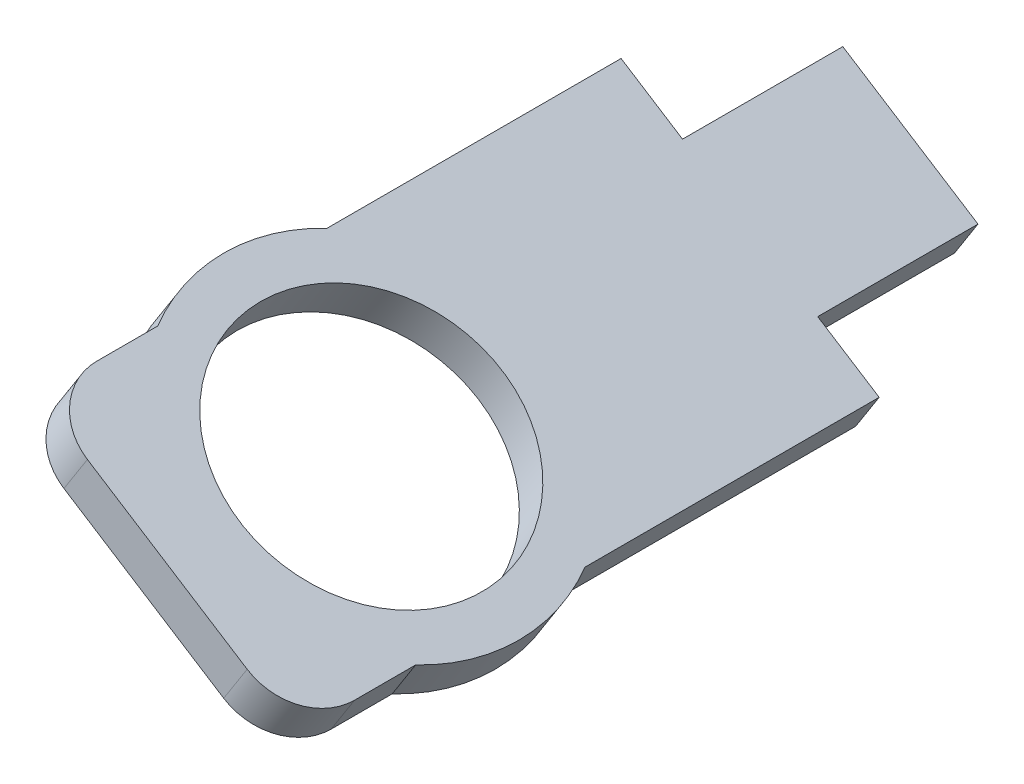
ISO-10303-21;
HEADER;
FILE_DESCRIPTION(('STEP AP214'),'2;1');
FILE_NAME('part.step','',(''),(''),'','','');
FILE_SCHEMA(('AUTOMOTIVE_DESIGN { 1 0 10303 214 1 1 1 1 }'));
ENDSEC;
DATA;
#1=APPLICATION_CONTEXT('core data for automotive mechanical design processes');
#2=APPLICATION_PROTOCOL_DEFINITION('international standard','automotive_design',2000,#1);
#3=PRODUCT_CONTEXT('',#1,'mechanical');
#4=PRODUCT('Part','Part','',(#3));
#5=PRODUCT_RELATED_PRODUCT_CATEGORY('part','',(#4));
#6=PRODUCT_DEFINITION_FORMATION('','',#4);
#7=PRODUCT_DEFINITION_CONTEXT('part definition',#1,'design');
#8=PRODUCT_DEFINITION('design','',#6,#7);
#9=PRODUCT_DEFINITION_SHAPE('','',#8);
#10=(LENGTH_UNIT() NAMED_UNIT(*) SI_UNIT(.MILLI.,.METRE.));
#11=(NAMED_UNIT(*) PLANE_ANGLE_UNIT() SI_UNIT($,.RADIAN.));
#12=(NAMED_UNIT(*) SI_UNIT($,.STERADIAN.) SOLID_ANGLE_UNIT());
#13=UNCERTAINTY_MEASURE_WITH_UNIT(LENGTH_MEASURE(1.E-05),#10,'distance_accuracy_value','');
#14=(GEOMETRIC_REPRESENTATION_CONTEXT(3) GLOBAL_UNCERTAINTY_ASSIGNED_CONTEXT((#13)) GLOBAL_UNIT_ASSIGNED_CONTEXT((#10,
#11,#12)) REPRESENTATION_CONTEXT('',''));
#15=CARTESIAN_POINT('',(0.,0.,0.));
#16=DIRECTION('',(0.,0.,1.));
#17=DIRECTION('',(1.,0.,0.));
#18=AXIS2_PLACEMENT_3D('',#15,#16,#17);
#19=CARTESIAN_POINT('',(-27.8262234514082,23.4806140199249,40.));
#20=DIRECTION('',(-0.843391445808128,0.537299608354292,0.));
#21=DIRECTION('',(-0.537299608354292,-0.843391445808128,0.));
#22=AXIS2_PLACEMENT_3D('',#19,#20,#21);
#23=PLANE('',#22);
#24=DIRECTION('',(0.,0.,-1.));
#25=VECTOR('',#24,1.);
#26=CARTESIAN_POINT('',(-26.2143246263453,26.0107883573493,40.));
#27=LINE('',#26,#25);
#28=CARTESIAN_POINT('',(-26.2143246263453,26.0107883573493,36.));
#29=VERTEX_POINT('',#28);
#30=CARTESIAN_POINT('',(-26.2143246263453,26.0107883573493,31.8094750193113));
#31=VERTEX_POINT('',#30);
#32=EDGE_CURVE('E201',#29,#31,#27,.T.);
#33=ORIENTED_EDGE('',*,*,#32,.F.);
#34=DIRECTION('',(0.537299608354292,0.843391445808128,0.));
#35=VECTOR('',#34,1.);
#36=CARTESIAN_POINT('',(-27.8262234514082,23.4806140199249,36.));
#37=LINE('',#36,#35);
#38=CARTESIAN_POINT('',(-27.8262234514082,23.4806140199249,36.));
#39=VERTEX_POINT('',#38);
#40=EDGE_CURVE('E11',#29,#39,#37,.F.);
#41=ORIENTED_EDGE('',*,*,#40,.T.);
#42=DIRECTION('',(0.,0.,-1.));
#43=VECTOR('',#42,1.);
#44=CARTESIAN_POINT('',(-27.8262234514082,23.4806140199249,40.));
#45=LINE('',#44,#43);
#46=CARTESIAN_POINT('',(-27.8262234514082,23.4806140199249,31.8094750193113));
#47=VERTEX_POINT('',#46);
#48=EDGE_CURVE('E151',#39,#47,#45,.T.);
#49=ORIENTED_EDGE('',*,*,#48,.T.);
#50=DIRECTION('',(0.53729960835429,0.843391445808129,0.));
#51=VECTOR('',#50,1.);
#52=CARTESIAN_POINT('',(-46.0627768880257,-5.14504088530657,31.8094750193115));
#53=LINE('',#52,#51);
#54=EDGE_CURVE('E161',#47,#31,#53,.T.);
#55=ORIENTED_EDGE('',*,*,#54,.T.);
#56=EDGE_LOOP('',(#33,#41,#49,#55));
#57=FACE_BOUND('',#56,.T.);
#58=ADVANCED_FACE('F38',(#57),#23,.F.);
#59=CARTESIAN_POINT('',(-43.925544988316,37.2940801327893,40.));
#60=DIRECTION('',(0.843391445808129,-0.537299608354291,0.));
#61=DIRECTION('',(0.537299608354291,0.843391445808129,0.));
#62=AXIS2_PLACEMENT_3D('',#59,#60,#61);
#63=PLANE('',#62);
#64=DIRECTION('',(0.,0.,-1.));
#65=VECTOR('',#64,1.);
#66=CARTESIAN_POINT('',(-45.5374438133789,34.763905795365,40.));
#67=LINE('',#66,#65);
#68=CARTESIAN_POINT('',(-45.5374438133789,34.763905795365,20.190524980689));
#69=VERTEX_POINT('',#68);
#70=CARTESIAN_POINT('',(-45.5374438133789,34.763905795365,0.));
#71=VERTEX_POINT('',#70);
#72=EDGE_CURVE('E195',#69,#71,#67,.T.);
#73=ORIENTED_EDGE('',*,*,#72,.F.);
#74=DIRECTION('',(0.53729960835429,0.843391445808129,0.));
#75=VECTOR('',#74,1.);
#76=CARTESIAN_POINT('',(-63.7739972499963,6.13825089013352,20.1905249806891));
#77=LINE('',#76,#75);
#78=CARTESIAN_POINT('',(-43.925544988316,37.2940801327894,20.190524980689));
#79=VERTEX_POINT('',#78);
#80=EDGE_CURVE('E232',#69,#79,#77,.T.);
#81=ORIENTED_EDGE('',*,*,#80,.T.);
#82=DIRECTION('',(0.,0.,-1.));
#83=VECTOR('',#82,1.);
#84=CARTESIAN_POINT('',(-43.925544988316,37.2940801327893,40.));
#85=LINE('',#84,#83);
#86=CARTESIAN_POINT('',(-43.925544988316,37.2940801327893,0.));
#87=VERTEX_POINT('',#86);
#88=EDGE_CURVE('E198',#79,#87,#85,.T.);
#89=ORIENTED_EDGE('',*,*,#88,.T.);
#90=DIRECTION('',(-0.537299608354291,-0.843391445808129,0.));
#91=VECTOR('',#90,1.);
#92=CARTESIAN_POINT('',(-43.925544988316,37.2940801327893,0.));
#93=LINE('',#92,#91);
#94=EDGE_CURVE('E190',#87,#71,#93,.T.);
#95=ORIENTED_EDGE('',*,*,#94,.T.);
#96=EDGE_LOOP('',(#73,#81,#89,#95));
#97=FACE_BOUND('',#96,.T.);
#98=ADVANCED_FACE('F273',(#97),#63,.F.);
#99=CARTESIAN_POINT('',(20.1241157801377,21.2297377830745,-10.9999999999997));
#100=DIRECTION('',(0.,0.,-1.));
#101=DIRECTION('',(-1.,0.,0.));
#102=AXIS2_PLACEMENT_3D('',#99,#100,#101);
#103=PLANE('',#102);
#104=DIRECTION('',(-0.84339144580813,0.53729960835429,0.));
#105=VECTOR('',#104,1.);
#106=CARTESIAN_POINT('',(-30.4312818553861,28.6972863991208,-11.0000000000002));
#107=LINE('',#106,#105);
#108=CARTESIAN_POINT('',(-30.431281855386,28.6972863991207,-11.0000000000002));
#109=VERTEX_POINT('',#108);
#110=CARTESIAN_POINT('',(-39.7085877592754,34.6075820910179,-11.0000000000003));
#111=VERTEX_POINT('',#110);
#112=EDGE_CURVE('E213',#109,#111,#107,.T.);
#113=ORIENTED_EDGE('',*,*,#112,.F.);
#114=DIRECTION('',(0.537299608354292,0.843391445808128,0.));
#115=VECTOR('',#114,1.);
#116=CARTESIAN_POINT('',(-32.0431806804489,26.1671120616963,-11.0000000000002));
#117=LINE('',#116,#115);
#118=CARTESIAN_POINT('',(-32.0431806804489,26.1671120616963,-11.0000000000002));
#119=VERTEX_POINT('',#118);
#120=EDGE_CURVE('E218',#119,#109,#117,.T.);
#121=ORIENTED_EDGE('',*,*,#120,.F.);
#122=DIRECTION('',(0.843391445808129,-0.53729960835429,0.));
#123=VECTOR('',#122,1.);
#124=CARTESIAN_POINT('',(-41.3204865843384,32.0774077535936,-11.0000000000003));
#125=LINE('',#124,#123);
#126=CARTESIAN_POINT('',(-41.3204865843383,32.0774077535935,-11.0000000000003));
#127=VERTEX_POINT('',#126);
#128=EDGE_CURVE('E222',#127,#119,#125,.T.);
#129=ORIENTED_EDGE('',*,*,#128,.F.);
#130=DIRECTION('',(-0.53729960835429,-0.843391445808129,0.));
#131=VECTOR('',#130,1.);
#132=CARTESIAN_POINT('',(-39.7085877592754,34.6075820910179,-11.0000000000003));
#133=LINE('',#132,#131);
#134=EDGE_CURVE('E207',#111,#127,#133,.T.);
#135=ORIENTED_EDGE('',*,*,#134,.F.);
#136=EDGE_LOOP('',(#113,#121,#129,#135));
#137=FACE_BOUND('',#136,.T.);
#138=ADVANCED_FACE('F278',(#137),#103,.T.);
#139=CARTESIAN_POINT('',(-39.7085877592754,34.6075820910179,-24.777384147396));
#140=DIRECTION('',(-0.843391445808129,0.53729960835429,0.));
#141=DIRECTION('',(-0.53729960835429,-0.843391445808129,0.));
#142=AXIS2_PLACEMENT_3D('',#139,#140,#141);
#143=PLANE('',#142);
#144=DIRECTION('',(0.,0.,1.));
#145=VECTOR('',#144,1.);
#146=CARTESIAN_POINT('',(-39.7085877592754,34.6075820910179,-24.777384147396));
#147=LINE('',#146,#145);
#148=CARTESIAN_POINT('',(-39.7085877592754,34.6075820910179,0.));
#149=VERTEX_POINT('',#148);
#150=EDGE_CURVE('E216',#111,#149,#147,.T.);
#151=ORIENTED_EDGE('',*,*,#150,.F.);
#152=ORIENTED_EDGE('',*,*,#134,.T.);
#153=DIRECTION('',(0.,0.,1.));
#154=VECTOR('',#153,1.);
#155=CARTESIAN_POINT('',(-41.3204865843383,32.0774077535935,-24.777384147396));
#156=LINE('',#155,#154);
#157=CARTESIAN_POINT('',(-41.3204865843383,32.0774077535935,0.));
#158=VERTEX_POINT('',#157);
#159=EDGE_CURVE('E212',#127,#158,#156,.T.);
#160=ORIENTED_EDGE('',*,*,#159,.T.);
#161=DIRECTION('',(-0.53729960835429,-0.843391445808129,0.));
#162=VECTOR('',#161,1.);
#163=CARTESIAN_POINT('',(-39.7085877592754,34.6075820910179,0.));
#164=LINE('',#163,#162);
#165=EDGE_CURVE('E203',#149,#158,#164,.T.);
#166=ORIENTED_EDGE('',*,*,#165,.F.);
#167=EDGE_LOOP('',(#151,#152,#160,#166));
#168=FACE_BOUND('',#167,.T.);
#169=ADVANCED_FACE('F320',(#168),#143,.T.);
#170=CARTESIAN_POINT('',(-41.3204865843383,32.0774077535935,-24.777384147396));
#171=DIRECTION('',(-0.53729960835429,-0.843391445808129,0.));
#172=DIRECTION('',(0.843391445808129,-0.53729960835429,0.));
#173=AXIS2_PLACEMENT_3D('',#170,#171,#172);
#174=PLANE('',#173);
#175=CARTESIAN_POINT('',(-36.6818336323935,29.1222599076449,26.));
#176=DIRECTION('',(-0.53729960835429,-0.843391445808129,0.));
#177=DIRECTION('',(0.843391445808129,-0.53729960835429,0.));
#178=AXIS2_PLACEMENT_3D('',#175,#176,#177);
#179=CIRCLE('',#178,9.00000000000001);
#180=CARTESIAN_POINT('',(-29.0913106201204,24.2865634324563,26.));
#181=VERTEX_POINT('',#180);
#182=EDGE_CURVE('E168',#181,#181,#179,.T.);
#183=ORIENTED_EDGE('',*,*,#182,.F.);
#184=EDGE_LOOP('',(#183));
#185=FACE_BOUND('',#184,.T.);
#186=DIRECTION('',(0.843391445808129,-0.53729960835429,0.));
#187=VECTOR('',#186,1.);
#188=CARTESIAN_POINT('',(-32.0431806804489,26.1671120616963,40.));
#189=LINE('',#188,#187);
#190=CARTESIAN_POINT('',(-42.1638780301464,32.6147073619478,40.));
#191=VERTEX_POINT('',#190);
#192=CARTESIAN_POINT('',(-31.1997892346407,25.629812453342,40.));
#193=VERTEX_POINT('',#192);
#194=EDGE_CURVE('E152',#191,#193,#189,.T.);
#195=ORIENTED_EDGE('',*,*,#194,.F.);
#196=CARTESIAN_POINT('',(-42.1638780301464,32.6147073619478,36.));
#197=DIRECTION('',(-0.53729960835429,-0.843391445808129,0.));
#198=DIRECTION('',(0.843391445808129,-0.53729960835429,0.));
#199=AXIS2_PLACEMENT_3D('',#196,#197,#198);
#200=CIRCLE('',#199,4.);
#201=CARTESIAN_POINT('',(-45.5374438133789,34.763905795365,36.));
#202=VERTEX_POINT('',#201);
#203=EDGE_CURVE('E243',#191,#202,#200,.T.);
#204=ORIENTED_EDGE('',*,*,#203,.T.);
#205=CARTESIAN_POINT('',(-45.5374438133789,34.7639057953649,31.809475019311));
#206=VERTEX_POINT('',#205);
#207=EDGE_CURVE('E196',#202,#206,#67,.T.);
#208=ORIENTED_EDGE('',*,*,#207,.T.);
#209=CARTESIAN_POINT('',(-36.6818336323935,29.1222599076449,26.));
#210=DIRECTION('',(-0.53729960835429,-0.843391445808129,0.));
#211=DIRECTION('',(0.843391445808129,-0.53729960835429,0.));
#212=AXIS2_PLACEMENT_3D('',#209,#210,#211);
#213=CIRCLE('',#212,12.);
#214=EDGE_CURVE('E167',#69,#206,#213,.F.);
#215=ORIENTED_EDGE('',*,*,#214,.F.);
#216=ORIENTED_EDGE('',*,*,#72,.T.);
#217=DIRECTION('',(0.843391445808128,-0.537299608354292,0.));
#218=VECTOR('',#217,1.);
#219=CARTESIAN_POINT('',(-32.0431806804489,26.1671120616963,0.));
#220=LINE('',#219,#218);
#221=EDGE_CURVE('E182',#71,#158,#220,.T.);
#222=ORIENTED_EDGE('',*,*,#221,.T.);
#223=ORIENTED_EDGE('',*,*,#159,.F.);
#224=ORIENTED_EDGE('',*,*,#128,.T.);
#225=DIRECTION('',(0.,0.,1.));
#226=VECTOR('',#225,1.);
#227=CARTESIAN_POINT('',(-32.0431806804489,26.1671120616963,-24.777384147396));
#228=LINE('',#227,#226);
#229=CARTESIAN_POINT('',(-32.0431806804489,26.1671120616963,0.));
#230=VERTEX_POINT('',#229);
#231=EDGE_CURVE('E221',#119,#230,#228,.T.);
#232=ORIENTED_EDGE('',*,*,#231,.T.);
#233=CARTESIAN_POINT('',(-27.8262234514082,23.4806140199249,0.));
#234=VERTEX_POINT('',#233);
#235=EDGE_CURVE('E147',#230,#234,#220,.T.);
#236=ORIENTED_EDGE('',*,*,#235,.T.);
#237=CARTESIAN_POINT('',(-27.8262234514082,23.4806140199249,20.1905249806887));
#238=VERTEX_POINT('',#237);
#239=EDGE_CURVE('E139',#238,#234,#45,.T.);
#240=ORIENTED_EDGE('',*,*,#239,.F.);
#241=EDGE_CURVE('E145',#47,#238,#213,.F.);
#242=ORIENTED_EDGE('',*,*,#241,.F.);
#243=ORIENTED_EDGE('',*,*,#48,.F.);
#244=CARTESIAN_POINT('',(-31.1997892346407,25.629812453342,36.));
#245=DIRECTION('',(-0.53729960835429,-0.843391445808129,0.));
#246=DIRECTION('',(0.843391445808129,-0.53729960835429,0.));
#247=AXIS2_PLACEMENT_3D('',#244,#245,#246);
#248=CIRCLE('',#247,4.);
#249=EDGE_CURVE('E241',#39,#193,#248,.T.);
#250=ORIENTED_EDGE('',*,*,#249,.T.);
#251=EDGE_LOOP('',(#195,#204,#208,#215,#216,#222,#223,#224,#232,#236,#240,#242,#243,#250));
#252=FACE_BOUND('',#251,.T.);
#253=ADVANCED_FACE('F142',(#185,#252),#174,.T.);
#254=CARTESIAN_POINT('',(-32.0431806804489,26.1671120616963,-24.777384147396));
#255=DIRECTION('',(0.843391445808128,-0.537299608354292,0.));
#256=DIRECTION('',(0.537299608354292,0.843391445808128,0.));
#257=AXIS2_PLACEMENT_3D('',#254,#255,#256);
#258=PLANE('',#257);
#259=ORIENTED_EDGE('',*,*,#231,.F.);
#260=ORIENTED_EDGE('',*,*,#120,.T.);
#261=DIRECTION('',(0.,0.,1.));
#262=VECTOR('',#261,1.);
#263=CARTESIAN_POINT('',(-30.431281855386,28.6972863991207,-24.777384147396));
#264=LINE('',#263,#262);
#265=CARTESIAN_POINT('',(-30.431281855386,28.6972863991207,0.));
#266=VERTEX_POINT('',#265);
#267=EDGE_CURVE('E217',#109,#266,#264,.T.);
#268=ORIENTED_EDGE('',*,*,#267,.T.);
#269=DIRECTION('',(0.537299608354292,0.843391445808128,0.));
#270=VECTOR('',#269,1.);
#271=CARTESIAN_POINT('',(-32.0431806804489,26.1671120616963,0.));
#272=LINE('',#271,#270);
#273=EDGE_CURVE('E204',#230,#266,#272,.T.);
#274=ORIENTED_EDGE('',*,*,#273,.F.);
#275=EDGE_LOOP('',(#259,#260,#268,#274));
#276=FACE_BOUND('',#275,.T.);
#277=ADVANCED_FACE('F311',(#276),#258,.T.);
#278=CARTESIAN_POINT('',(-30.431281855386,28.6972863991207,-24.777384147396));
#279=DIRECTION('',(0.537299608354289,0.84339144580813,0.));
#280=DIRECTION('',(-0.84339144580813,0.53729960835429,0.));
#281=AXIS2_PLACEMENT_3D('',#278,#279,#280);
#282=PLANE('',#281);
#283=CARTESIAN_POINT('',(-35.0699348073307,31.6524342450693,26.));
#284=DIRECTION('',(0.53729960835429,0.84339144580813,0.));
#285=DIRECTION('',(-0.84339144580813,0.53729960835429,0.));
#286=AXIS2_PLACEMENT_3D('',#283,#284,#285);
#287=CIRCLE('',#286,9.00000000000001);
#288=CARTESIAN_POINT('',(-42.6604578196038,36.4881307202579,26.));
#289=VERTEX_POINT('',#288);
#290=EDGE_CURVE('E173',#289,#289,#287,.T.);
#291=ORIENTED_EDGE('',*,*,#290,.F.);
#292=EDGE_LOOP('',(#291));
#293=FACE_BOUND('',#292,.T.);
#294=CARTESIAN_POINT('',(-43.925544988316,37.2940801327893,36.));
#295=VERTEX_POINT('',#294);
#296=CARTESIAN_POINT('',(-43.925544988316,37.2940801327894,31.809475019311));
#297=VERTEX_POINT('',#296);
#298=EDGE_CURVE('E199',#295,#297,#85,.T.);
#299=ORIENTED_EDGE('',*,*,#298,.F.);
#300=CARTESIAN_POINT('',(-40.5519792050835,35.1448816993722,36.));
#301=DIRECTION('',(0.537299608354289,0.84339144580813,0.));
#302=DIRECTION('',(-0.84339144580813,0.53729960835429,0.));
#303=AXIS2_PLACEMENT_3D('',#300,#301,#302);
#304=CIRCLE('',#303,4.);
#305=CARTESIAN_POINT('',(-40.5519792050835,35.1448816993722,40.));
#306=VERTEX_POINT('',#305);
#307=EDGE_CURVE('E46',#295,#306,#304,.T.);
#308=ORIENTED_EDGE('',*,*,#307,.T.);
#309=DIRECTION('',(-0.843391445808129,0.53729960835429,0.));
#310=VECTOR('',#309,1.);
#311=CARTESIAN_POINT('',(-26.2143246263453,26.0107883573493,40.));
#312=LINE('',#311,#310);
#313=CARTESIAN_POINT('',(-29.5878904095779,28.1599867907664,40.));
#314=VERTEX_POINT('',#313);
#315=EDGE_CURVE('E179',#314,#306,#312,.T.);
#316=ORIENTED_EDGE('',*,*,#315,.F.);
#317=CARTESIAN_POINT('',(-29.5878904095778,28.1599867907664,36.));
#318=DIRECTION('',(0.537299608354289,0.84339144580813,0.));
#319=DIRECTION('',(-0.84339144580813,0.53729960835429,0.));
#320=AXIS2_PLACEMENT_3D('',#317,#318,#319);
#321=CIRCLE('',#320,4.);
#322=EDGE_CURVE('E53',#314,#29,#321,.T.);
#323=ORIENTED_EDGE('',*,*,#322,.T.);
#324=ORIENTED_EDGE('',*,*,#32,.T.);
#325=CARTESIAN_POINT('',(-35.0699348073306,31.6524342450693,26.));
#326=DIRECTION('',(0.53729960835429,0.84339144580813,0.));
#327=DIRECTION('',(-0.84339144580813,0.53729960835429,0.));
#328=AXIS2_PLACEMENT_3D('',#325,#326,#327);
#329=CIRCLE('',#328,12.);
#330=CARTESIAN_POINT('',(-26.2143246263453,26.0107883573493,20.1905249806888));
#331=VERTEX_POINT('',#330);
#332=EDGE_CURVE('E162',#31,#331,#329,.T.);
#333=ORIENTED_EDGE('',*,*,#332,.T.);
#334=CARTESIAN_POINT('',(-26.2143246263453,26.0107883573493,0.));
#335=VERTEX_POINT('',#334);
#336=EDGE_CURVE('E157',#331,#335,#27,.T.);
#337=ORIENTED_EDGE('',*,*,#336,.T.);
#338=DIRECTION('',(-0.843391445808129,0.53729960835429,0.));
#339=VECTOR('',#338,1.);
#340=CARTESIAN_POINT('',(-26.2143246263453,26.0107883573493,0.));
#341=LINE('',#340,#339);
#342=EDGE_CURVE('E187',#335,#266,#341,.T.);
#343=ORIENTED_EDGE('',*,*,#342,.T.);
#344=ORIENTED_EDGE('',*,*,#267,.F.);
#345=ORIENTED_EDGE('',*,*,#112,.T.);
#346=ORIENTED_EDGE('',*,*,#150,.T.);
#347=EDGE_CURVE('E186',#149,#87,#341,.T.);
#348=ORIENTED_EDGE('',*,*,#347,.T.);
#349=ORIENTED_EDGE('',*,*,#88,.F.);
#350=EDGE_CURVE('E171',#79,#297,#329,.T.);
#351=ORIENTED_EDGE('',*,*,#350,.T.);
#352=EDGE_LOOP('',(#299,#308,#316,#323,#324,#333,#337,#343,#344,#345,#346,#348,#349,#351));
#353=FACE_BOUND('',#352,.T.);
#354=ADVANCED_FACE('F247',(#293,#353),#282,.T.);
#355=CARTESIAN_POINT('',(0.,0.,0.));
#356=DIRECTION('',(0.,0.,1.));
#357=DIRECTION('',(1.,0.,0.));
#358=AXIS2_PLACEMENT_3D('',#355,#356,#357);
#359=PLANE('',#358);
#360=ORIENTED_EDGE('',*,*,#347,.F.);
#361=ORIENTED_EDGE('',*,*,#165,.T.);
#362=ORIENTED_EDGE('',*,*,#221,.F.);
#363=ORIENTED_EDGE('',*,*,#94,.F.);
#364=EDGE_LOOP('',(#360,#361,#362,#363));
#365=FACE_BOUND('',#364,.T.);
#366=ADVANCED_FACE('F288',(#365),#359,.F.);
#367=ORIENTED_EDGE('',*,*,#235,.F.);
#368=ORIENTED_EDGE('',*,*,#273,.T.);
#369=ORIENTED_EDGE('',*,*,#342,.F.);
#370=DIRECTION('',(0.537299608354292,0.843391445808128,0.));
#371=VECTOR('',#370,1.);
#372=CARTESIAN_POINT('',(-27.8262234514082,23.4806140199249,0.));
#373=LINE('',#372,#371);
#374=EDGE_CURVE('E178',#234,#335,#373,.T.);
#375=ORIENTED_EDGE('',*,*,#374,.F.);
#376=EDGE_LOOP('',(#367,#368,#369,#375));
#377=FACE_BOUND('',#376,.T.);
#378=ADVANCED_FACE('F283',(#377),#359,.F.);
#379=ORIENTED_EDGE('',*,*,#336,.F.);
#380=DIRECTION('',(0.53729960835429,0.843391445808129,0.));
#381=VECTOR('',#380,1.);
#382=CARTESIAN_POINT('',(-46.0627768880257,-5.14504088530657,20.1905249806885));
#383=LINE('',#382,#381);
#384=EDGE_CURVE('E155',#331,#238,#383,.F.);
#385=ORIENTED_EDGE('',*,*,#384,.T.);
#386=ORIENTED_EDGE('',*,*,#239,.T.);
#387=ORIENTED_EDGE('',*,*,#374,.T.);
#388=EDGE_LOOP('',(#379,#385,#386,#387));
#389=FACE_BOUND('',#388,.T.);
#390=ADVANCED_FACE('F156',(#389),#23,.F.);
#391=ORIENTED_EDGE('',*,*,#207,.F.);
#392=DIRECTION('',(-0.537299608354291,-0.843391445808129,0.));
#393=VECTOR('',#392,1.);
#394=CARTESIAN_POINT('',(-43.925544988316,37.2940801327893,36.));
#395=LINE('',#394,#393);
#396=EDGE_CURVE('E61',#202,#295,#395,.F.);
#397=ORIENTED_EDGE('',*,*,#396,.T.);
#398=ORIENTED_EDGE('',*,*,#298,.T.);
#399=DIRECTION('',(0.53729960835429,0.843391445808129,0.));
#400=VECTOR('',#399,1.);
#401=CARTESIAN_POINT('',(-63.7739972499963,6.13825089013352,31.8094750193109));
#402=LINE('',#401,#400);
#403=EDGE_CURVE('E229',#297,#206,#402,.F.);
#404=ORIENTED_EDGE('',*,*,#403,.T.);
#405=EDGE_LOOP('',(#391,#397,#398,#404));
#406=FACE_BOUND('',#405,.T.);
#407=ADVANCED_FACE('F255',(#406),#63,.F.);
#408=CARTESIAN_POINT('',(0.,0.,40.));
#409=DIRECTION('',(0.,0.,1.));
#410=DIRECTION('',(1.,0.,0.));
#411=AXIS2_PLACEMENT_3D('',#408,#409,#410);
#412=PLANE('',#411);
#413=ORIENTED_EDGE('',*,*,#315,.T.);
#414=DIRECTION('',(-0.537299608354291,-0.843391445808129,0.));
#415=VECTOR('',#414,1.);
#416=CARTESIAN_POINT('',(-42.1638780301464,32.6147073619478,40.));
#417=LINE('',#416,#415);
#418=EDGE_CURVE('E238',#306,#191,#417,.T.);
#419=ORIENTED_EDGE('',*,*,#418,.T.);
#420=ORIENTED_EDGE('',*,*,#194,.T.);
#421=DIRECTION('',(0.537299608354292,0.843391445808128,0.));
#422=VECTOR('',#421,1.);
#423=CARTESIAN_POINT('',(-29.5878904095778,28.1599867907664,40.));
#424=LINE('',#423,#422);
#425=EDGE_CURVE('E235',#193,#314,#424,.T.);
#426=ORIENTED_EDGE('',*,*,#425,.T.);
#427=EDGE_LOOP('',(#413,#419,#420,#426));
#428=FACE_BOUND('',#427,.T.);
#429=ADVANCED_FACE('F252',(#428),#412,.T.);
#430=CARTESIAN_POINT('',(-54.9183870690109,0.496605002413403,26.));
#431=DIRECTION('',(0.53729960835429,0.843391445808129,0.));
#432=DIRECTION('',(-0.843391445808129,0.53729960835429,0.));
#433=AXIS2_PLACEMENT_3D('',#430,#431,#432);
#434=CYLINDRICAL_SURFACE('',#433,12.);
#435=ORIENTED_EDGE('',*,*,#80,.F.);
#436=ORIENTED_EDGE('',*,*,#214,.T.);
#437=ORIENTED_EDGE('',*,*,#403,.F.);
#438=ORIENTED_EDGE('',*,*,#350,.F.);
#439=EDGE_LOOP('',(#435,#436,#437,#438));
#440=FACE_BOUND('',#439,.T.);
#441=ADVANCED_FACE('F259',(#440),#434,.T.);
#442=ORIENTED_EDGE('',*,*,#54,.F.);
#443=ORIENTED_EDGE('',*,*,#241,.T.);
#444=ORIENTED_EDGE('',*,*,#384,.F.);
#445=ORIENTED_EDGE('',*,*,#332,.F.);
#446=EDGE_LOOP('',(#442,#443,#444,#445));
#447=FACE_BOUND('',#446,.T.);
#448=ADVANCED_FACE('F165',(#447),#434,.T.);
#449=CARTESIAN_POINT('',(-40.4429308908735,23.218519786988,26.));
#450=DIRECTION('',(0.53729960835429,0.84339144580813,0.));
#451=DIRECTION('',(-0.84339144580813,0.53729960835429,0.));
#452=AXIS2_PLACEMENT_3D('',#449,#450,#451);
#453=CYLINDRICAL_SURFACE('',#452,9.00000000000001);
#454=ORIENTED_EDGE('',*,*,#182,.T.);
#455=EDGE_LOOP('',(#454));
#456=FACE_BOUND('',#455,.T.);
#457=ORIENTED_EDGE('',*,*,#290,.T.);
#458=EDGE_LOOP('',(#457));
#459=FACE_BOUND('',#458,.T.);
#460=ADVANCED_FACE('F271',(#456,#459),#453,.F.);
#461=CARTESIAN_POINT('',(-44.771033062558,28.522293710342,36.));
#462=DIRECTION('',(0.537299608354291,0.843391445808129,0.));
#463=DIRECTION('',(-0.843391445808129,0.537299608354291,0.));
#464=AXIS2_PLACEMENT_3D('',#461,#462,#463);
#465=CYLINDRICAL_SURFACE('',#464,4.);
#466=ORIENTED_EDGE('',*,*,#307,.F.);
#467=ORIENTED_EDGE('',*,*,#396,.F.);
#468=ORIENTED_EDGE('',*,*,#203,.F.);
#469=ORIENTED_EDGE('',*,*,#418,.F.);
#470=EDGE_LOOP('',(#466,#467,#468,#469));
#471=FACE_BOUND('',#470,.T.);
#472=ADVANCED_FACE('F254',(#471),#465,.T.);
#473=CARTESIAN_POINT('',(-33.8069442670523,21.5373988017363,36.));
#474=DIRECTION('',(-0.537299608354292,-0.843391445808128,0.));
#475=DIRECTION('',(0.843391445808128,-0.537299608354292,0.));
#476=AXIS2_PLACEMENT_3D('',#473,#474,#475);
#477=CYLINDRICAL_SURFACE('',#476,4.);
#478=ORIENTED_EDGE('',*,*,#249,.F.);
#479=ORIENTED_EDGE('',*,*,#40,.F.);
#480=ORIENTED_EDGE('',*,*,#322,.F.);
#481=ORIENTED_EDGE('',*,*,#425,.F.);
#482=EDGE_LOOP('',(#478,#479,#480,#481));
#483=FACE_BOUND('',#482,.T.);
#484=ADVANCED_FACE('F40',(#483),#477,.T.);
#485=CLOSED_SHELL('',(#58,#98,#138,#169,#253,#277,#354,#366,#378,#390,#407,#429,#441,#448,#460,
#472,#484));
#486=MANIFOLD_SOLID_BREP('B2',#485);
#487=ADVANCED_BREP_SHAPE_REPRESENTATION('',(#18,#486),#14);
#488=SHAPE_DEFINITION_REPRESENTATION(#9,#487);
ENDSEC;
END-ISO-10303-21;
